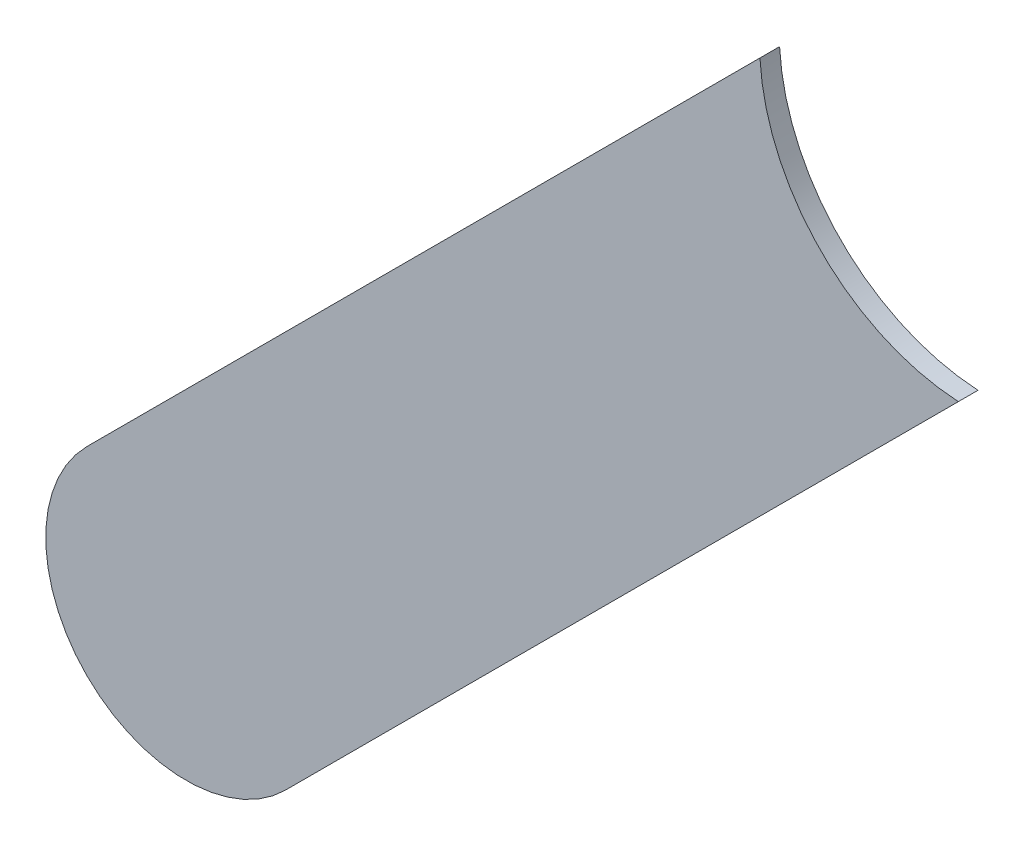
ISO-10303-21;
HEADER;
FILE_DESCRIPTION(('STEP AP214'),'2;1');
FILE_NAME('part.step','',(''),(''),'','','');
FILE_SCHEMA(('AUTOMOTIVE_DESIGN { 1 0 10303 214 1 1 1 1 }'));
ENDSEC;
DATA;
#1=APPLICATION_CONTEXT('core data for automotive mechanical design processes');
#2=APPLICATION_PROTOCOL_DEFINITION('international standard','automotive_design',2000,#1);
#3=PRODUCT_CONTEXT('',#1,'mechanical');
#4=PRODUCT('Part','Part','',(#3));
#5=PRODUCT_RELATED_PRODUCT_CATEGORY('part','',(#4));
#6=PRODUCT_DEFINITION_FORMATION('','',#4);
#7=PRODUCT_DEFINITION_CONTEXT('part definition',#1,'design');
#8=PRODUCT_DEFINITION('design','',#6,#7);
#9=PRODUCT_DEFINITION_SHAPE('','',#8);
#10=(LENGTH_UNIT() NAMED_UNIT(*) SI_UNIT(.MILLI.,.METRE.));
#11=(NAMED_UNIT(*) PLANE_ANGLE_UNIT() SI_UNIT($,.RADIAN.));
#12=(NAMED_UNIT(*) SI_UNIT($,.STERADIAN.) SOLID_ANGLE_UNIT());
#13=UNCERTAINTY_MEASURE_WITH_UNIT(LENGTH_MEASURE(1.E-05),#10,'distance_accuracy_value','');
#14=(GEOMETRIC_REPRESENTATION_CONTEXT(3) GLOBAL_UNCERTAINTY_ASSIGNED_CONTEXT((#13)) GLOBAL_UNIT_ASSIGNED_CONTEXT((#10,
#11,#12)) REPRESENTATION_CONTEXT('',''));
#15=CARTESIAN_POINT('',(0.,0.,0.));
#16=DIRECTION('',(0.,0.,1.));
#17=DIRECTION('',(1.,0.,0.));
#18=AXIS2_PLACEMENT_3D('',#15,#16,#17);
#19=CARTESIAN_POINT('',(169.086776,-145.210776,-0.035));
#20=DIRECTION('',(-0.707106781186548,0.707106781186548,0.));
#21=DIRECTION('',(0.,0.,1.));
#22=AXIS2_PLACEMENT_3D('',#19,#20,#21);
#23=PLANE('',#22);
#24=DIRECTION('',(0.,0.,-1.));
#25=VECTOR('',#24,1.);
#26=CARTESIAN_POINT('',(170.28613302434,-144.0114189756,-0.045));
#27=LINE('',#26,#25);
#28=CARTESIAN_POINT('',(170.28613302437,-144.0114189756,0.));
#29=VERTEX_POINT('',#28);
#30=CARTESIAN_POINT('',(170.28613302437,-144.0114189756,-0.035));
#31=VERTEX_POINT('',#30);
#32=EDGE_CURVE('E11',#29,#31,#27,.T.);
#33=ORIENTED_EDGE('',*,*,#32,.F.);
#34=DIRECTION('',(0.707106781186548,0.707106781186548,0.));
#35=VECTOR('',#34,1.);
#36=CARTESIAN_POINT('',(169.086776,-145.210776,0.));
#37=LINE('',#36,#35);
#38=CARTESIAN_POINT('',(169.086776,-145.210776,0.));
#39=VERTEX_POINT('',#38);
#40=EDGE_CURVE('E20',#39,#29,#37,.T.);
#41=ORIENTED_EDGE('',*,*,#40,.F.);
#42=DIRECTION('',(0.,0.,1.));
#43=VECTOR('',#42,1.);
#44=CARTESIAN_POINT('',(169.086776,-145.210776,-0.035));
#45=LINE('',#44,#43);
#46=CARTESIAN_POINT('',(169.086776,-145.210776,-0.035));
#47=VERTEX_POINT('',#46);
#48=EDGE_CURVE('E109',#47,#39,#45,.T.);
#49=ORIENTED_EDGE('',*,*,#48,.F.);
#50=DIRECTION('',(0.707106781186548,0.707106781186548,0.));
#51=VECTOR('',#50,1.);
#52=CARTESIAN_POINT('',(169.086776,-145.210776,-0.035));
#53=LINE('',#52,#51);
#54=EDGE_CURVE('E75',#47,#31,#53,.T.);
#55=ORIENTED_EDGE('',*,*,#54,.T.);
#56=EDGE_LOOP('',(#33,#41,#49,#55));
#57=FACE_BOUND('',#56,.T.);
#58=ADVANCED_FACE('F17',(#57),#23,.F.);
#59=CARTESIAN_POINT('',(170.307,-143.637,-0.045));
#60=DIRECTION('',(0.,0.,-1.));
#61=DIRECTION('',(0.,-1.,0.));
#62=AXIS2_PLACEMENT_3D('',#59,#60,#61);
#63=CYLINDRICAL_SURFACE('',#62,0.375);
#64=DIRECTION('',(0.,0.,-1.));
#65=VECTOR('',#64,1.);
#66=CARTESIAN_POINT('',(169.93258091877,-143.6578650812,-0.045));
#67=LINE('',#66,#65);
#68=CARTESIAN_POINT('',(169.93258091877,-143.6578650812,0.));
#69=VERTEX_POINT('',#68);
#70=CARTESIAN_POINT('',(169.93258091877,-143.6578650812,-0.035));
#71=VERTEX_POINT('',#70);
#72=EDGE_CURVE('E88',#69,#71,#67,.T.);
#73=ORIENTED_EDGE('',*,*,#72,.F.);
#74=CARTESIAN_POINT('',(170.307,-143.637,0.));
#75=DIRECTION('',(0.,0.,-1.));
#76=DIRECTION('',(0.,-1.,0.));
#77=AXIS2_PLACEMENT_3D('',#74,#75,#76);
#78=CIRCLE('',#77,0.375);
#79=EDGE_CURVE('E113',#29,#69,#78,.T.);
#80=ORIENTED_EDGE('',*,*,#79,.F.);
#81=ORIENTED_EDGE('',*,*,#32,.T.);
#82=CARTESIAN_POINT('',(170.307,-143.637,-0.035));
#83=DIRECTION('',(0.,0.,-1.));
#84=DIRECTION('',(0.,-1.,0.));
#85=AXIS2_PLACEMENT_3D('',#82,#83,#84);
#86=CIRCLE('',#85,0.375);
#87=EDGE_CURVE('E80',#31,#71,#86,.T.);
#88=ORIENTED_EDGE('',*,*,#87,.T.);
#89=EDGE_LOOP('',(#73,#80,#81,#88));
#90=FACE_BOUND('',#89,.T.);
#91=ADVANCED_FACE('F124',(#90),#63,.F.);
#92=CARTESIAN_POINT('',(170.130223,-143.460223,0.));
#93=DIRECTION('',(0.,0.,1.));
#94=DIRECTION('',(1.,0.,0.));
#95=AXIS2_PLACEMENT_3D('',#92,#93,#94);
#96=PLANE('',#95);
#97=ORIENTED_EDGE('',*,*,#79,.T.);
#98=DIRECTION('',(-0.707106781186548,-0.707106781186548,0.));
#99=VECTOR('',#98,1.);
#100=CARTESIAN_POINT('',(170.130223,-143.460223,0.));
#101=LINE('',#100,#99);
#102=CARTESIAN_POINT('',(168.733223,-144.857223,0.));
#103=VERTEX_POINT('',#102);
#104=EDGE_CURVE('E95',#69,#103,#101,.T.);
#105=ORIENTED_EDGE('',*,*,#104,.T.);
#106=CARTESIAN_POINT('',(168.9099995,-145.0339995,0.));
#107=DIRECTION('',(0.,0.,1.));
#108=DIRECTION('',(-0.707106781186548,0.707106781186548,0.));
#109=AXIS2_PLACEMENT_3D('',#106,#107,#108);
#110=CIRCLE('',#109,0.249999723809);
#111=EDGE_CURVE('E92',#103,#39,#110,.T.);
#112=ORIENTED_EDGE('',*,*,#111,.T.);
#113=ORIENTED_EDGE('',*,*,#40,.T.);
#114=EDGE_LOOP('',(#97,#105,#112,#113));
#115=FACE_BOUND('',#114,.T.);
#116=ADVANCED_FACE('F122',(#115),#96,.T.);
#117=CARTESIAN_POINT('',(168.9099995,-145.0339995,-0.035));
#118=DIRECTION('',(0.,0.,-1.));
#119=DIRECTION('',(-0.707106781186548,0.707106781186548,0.));
#120=AXIS2_PLACEMENT_3D('',#117,#118,#119);
#121=CYLINDRICAL_SURFACE('',#120,0.249999723809);
#122=CARTESIAN_POINT('',(168.9099995,-145.0339995,-0.035));
#123=DIRECTION('',(0.,0.,1.));
#124=DIRECTION('',(-0.707106781186548,0.707106781186548,0.));
#125=AXIS2_PLACEMENT_3D('',#122,#123,#124);
#126=CIRCLE('',#125,0.249999723809);
#127=CARTESIAN_POINT('',(168.733223,-144.857223,-0.035));
#128=VERTEX_POINT('',#127);
#129=EDGE_CURVE('E69',#128,#47,#126,.T.);
#130=ORIENTED_EDGE('',*,*,#129,.T.);
#131=ORIENTED_EDGE('',*,*,#48,.T.);
#132=ORIENTED_EDGE('',*,*,#111,.F.);
#133=DIRECTION('',(0.,0.,1.));
#134=VECTOR('',#133,1.);
#135=CARTESIAN_POINT('',(168.733223,-144.857223,-0.035));
#136=LINE('',#135,#134);
#137=EDGE_CURVE('E86',#128,#103,#136,.T.);
#138=ORIENTED_EDGE('',*,*,#137,.F.);
#139=EDGE_LOOP('',(#130,#131,#132,#138));
#140=FACE_BOUND('',#139,.T.);
#141=ADVANCED_FACE('F91',(#140),#121,.T.);
#142=CARTESIAN_POINT('',(170.130223,-143.460223,-0.035));
#143=DIRECTION('',(0.,0.,1.));
#144=DIRECTION('',(1.,0.,0.));
#145=AXIS2_PLACEMENT_3D('',#142,#143,#144);
#146=PLANE('',#145);
#147=ORIENTED_EDGE('',*,*,#54,.F.);
#148=ORIENTED_EDGE('',*,*,#129,.F.);
#149=DIRECTION('',(-0.707106781186548,-0.707106781186548,0.));
#150=VECTOR('',#149,1.);
#151=CARTESIAN_POINT('',(170.130223,-143.460223,-0.035));
#152=LINE('',#151,#150);
#153=EDGE_CURVE('E73',#71,#128,#152,.T.);
#154=ORIENTED_EDGE('',*,*,#153,.F.);
#155=ORIENTED_EDGE('',*,*,#87,.F.);
#156=EDGE_LOOP('',(#147,#148,#154,#155));
#157=FACE_BOUND('',#156,.T.);
#158=ADVANCED_FACE('F71',(#157),#146,.F.);
#159=CARTESIAN_POINT('',(170.130223,-143.460223,-0.035));
#160=DIRECTION('',(0.707106781186548,-0.707106781186548,0.));
#161=DIRECTION('',(0.,0.,-1.));
#162=AXIS2_PLACEMENT_3D('',#159,#160,#161);
#163=PLANE('',#162);
#164=ORIENTED_EDGE('',*,*,#137,.T.);
#165=ORIENTED_EDGE('',*,*,#104,.F.);
#166=ORIENTED_EDGE('',*,*,#72,.T.);
#167=ORIENTED_EDGE('',*,*,#153,.T.);
#168=EDGE_LOOP('',(#164,#165,#166,#167));
#169=FACE_BOUND('',#168,.T.);
#170=ADVANCED_FACE('F84',(#169),#163,.F.);
#171=CLOSED_SHELL('',(#58,#91,#116,#141,#158,#170));
#172=MANIFOLD_SOLID_BREP('B1',#171);
#173=ADVANCED_BREP_SHAPE_REPRESENTATION('',(#18,#172),#14);
#174=SHAPE_DEFINITION_REPRESENTATION(#9,#173);
ENDSEC;
END-ISO-10303-21;
